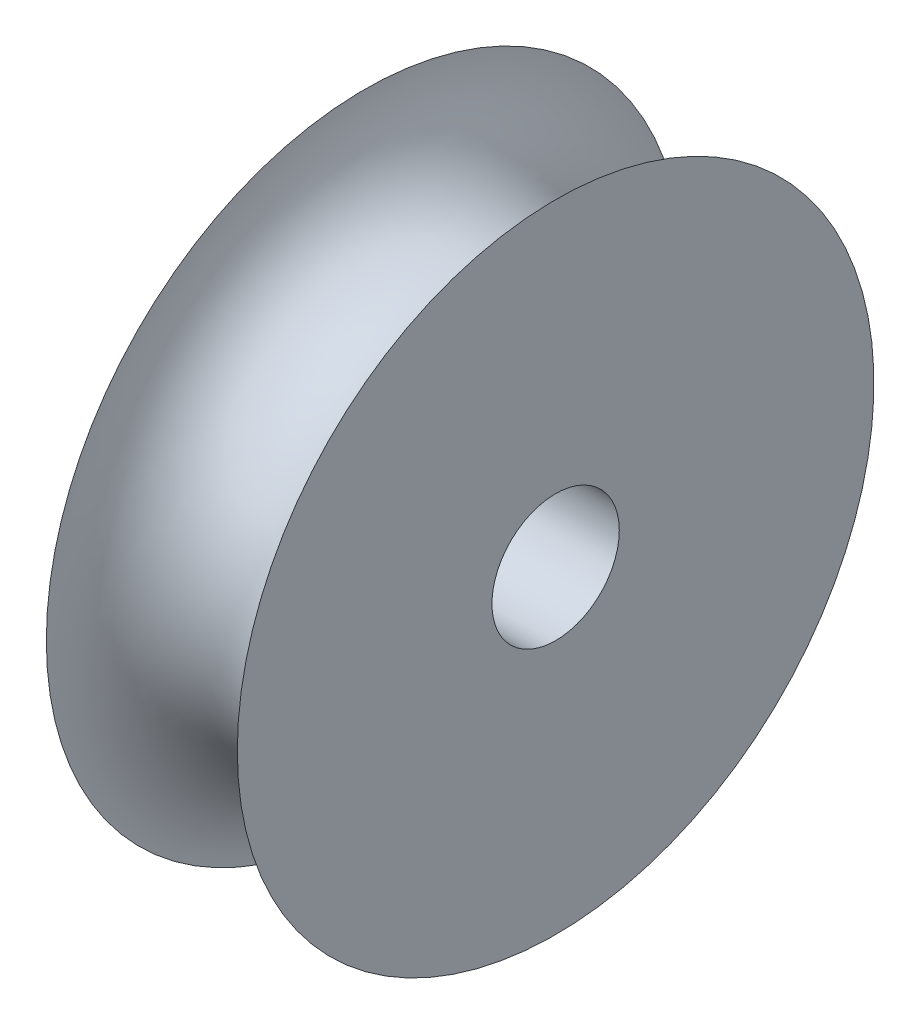
ISO-10303-21;
HEADER;
FILE_DESCRIPTION(('STEP AP214'),'2;1');
FILE_NAME('part.step','',(''),(''),'','','');
FILE_SCHEMA(('AUTOMOTIVE_DESIGN { 1 0 10303 214 1 1 1 1 }'));
ENDSEC;
DATA;
#1=APPLICATION_CONTEXT('core data for automotive mechanical design processes');
#2=APPLICATION_PROTOCOL_DEFINITION('international standard','automotive_design',2000,#1);
#3=PRODUCT_CONTEXT('',#1,'mechanical');
#4=PRODUCT('Part','Part','',(#3));
#5=PRODUCT_RELATED_PRODUCT_CATEGORY('part','',(#4));
#6=PRODUCT_DEFINITION_FORMATION('','',#4);
#7=PRODUCT_DEFINITION_CONTEXT('part definition',#1,'design');
#8=PRODUCT_DEFINITION('design','',#6,#7);
#9=PRODUCT_DEFINITION_SHAPE('','',#8);
#10=(LENGTH_UNIT() NAMED_UNIT(*) SI_UNIT(.MILLI.,.METRE.));
#11=(NAMED_UNIT(*) PLANE_ANGLE_UNIT() SI_UNIT($,.RADIAN.));
#12=(NAMED_UNIT(*) SI_UNIT($,.STERADIAN.) SOLID_ANGLE_UNIT());
#13=UNCERTAINTY_MEASURE_WITH_UNIT(LENGTH_MEASURE(1.E-05),#10,'distance_accuracy_value','');
#14=(GEOMETRIC_REPRESENTATION_CONTEXT(3) GLOBAL_UNCERTAINTY_ASSIGNED_CONTEXT((#13)) GLOBAL_UNIT_ASSIGNED_CONTEXT((#10,
#11,#12)) REPRESENTATION_CONTEXT('',''));
#15=CARTESIAN_POINT('',(0.,0.,0.));
#16=DIRECTION('',(0.,0.,1.));
#17=DIRECTION('',(1.,0.,0.));
#18=AXIS2_PLACEMENT_3D('',#15,#16,#17);
#19=CARTESIAN_POINT('',(4.7625,0.,0.));
#20=DIRECTION('',(-1.,0.,0.));
#21=DIRECTION('',(0.,0.,1.));
#22=AXIS2_PLACEMENT_3D('',#19,#20,#21);
#23=TOROIDAL_SURFACE('',#22,15.875,4.7625);
#24=CARTESIAN_POINT('',(0.,0.,0.));
#25=DIRECTION('',(-1.,0.,0.));
#26=DIRECTION('',(0.,0.,1.));
#27=AXIS2_PLACEMENT_3D('',#24,#25,#26);
#28=CIRCLE('',#27,15.875);
#29=CARTESIAN_POINT('',(0.,0.,15.875));
#30=VERTEX_POINT('',#29);
#31=EDGE_CURVE('E10',#30,#30,#28,.T.);
#32=ORIENTED_EDGE('',*,*,#31,.F.);
#33=EDGE_LOOP('',(#32));
#34=FACE_BOUND('',#33,.T.);
#35=CARTESIAN_POINT('',(9.525,0.,0.));
#36=DIRECTION('',(-1.,0.,0.));
#37=DIRECTION('',(0.,0.,1.));
#38=AXIS2_PLACEMENT_3D('',#35,#36,#37);
#39=CIRCLE('',#38,15.875);
#40=CARTESIAN_POINT('',(9.525,0.,15.875));
#41=VERTEX_POINT('',#40);
#42=EDGE_CURVE('E37',#41,#41,#39,.T.);
#43=ORIENTED_EDGE('',*,*,#42,.T.);
#44=EDGE_LOOP('',(#43));
#45=FACE_BOUND('',#44,.T.);
#46=ADVANCED_FACE('F31',(#34,#45),#23,.F.);
#47=CARTESIAN_POINT('',(0.,15.875,0.));
#48=DIRECTION('',(1.,0.,0.));
#49=DIRECTION('',(0.,0.,-1.));
#50=AXIS2_PLACEMENT_3D('',#47,#48,#49);
#51=PLANE('',#50);
#52=CARTESIAN_POINT('',(0.,0.,0.));
#53=DIRECTION('',(1.,0.,0.));
#54=DIRECTION('',(0.,0.,-1.));
#55=AXIS2_PLACEMENT_3D('',#52,#53,#54);
#56=CIRCLE('',#55,3.175);
#57=CARTESIAN_POINT('',(0.,0.,-3.175));
#58=VERTEX_POINT('',#57);
#59=EDGE_CURVE('E41',#58,#58,#56,.T.);
#60=ORIENTED_EDGE('',*,*,#59,.T.);
#61=EDGE_LOOP('',(#60));
#62=FACE_BOUND('',#61,.T.);
#63=ORIENTED_EDGE('',*,*,#31,.T.);
#64=EDGE_LOOP('',(#63));
#65=FACE_BOUND('',#64,.T.);
#66=ADVANCED_FACE('F56',(#62,#65),#51,.F.);
#67=CARTESIAN_POINT('',(9.525,0.,0.));
#68=DIRECTION('',(-1.,0.,0.));
#69=DIRECTION('',(0.,0.,1.));
#70=AXIS2_PLACEMENT_3D('',#67,#68,#69);
#71=PLANE('',#70);
#72=CARTESIAN_POINT('',(9.525,0.,0.));
#73=DIRECTION('',(1.,0.,0.));
#74=DIRECTION('',(0.,0.,-1.));
#75=AXIS2_PLACEMENT_3D('',#72,#73,#74);
#76=CIRCLE('',#75,3.175);
#77=CARTESIAN_POINT('',(9.525,0.,-3.175));
#78=VERTEX_POINT('',#77);
#79=EDGE_CURVE('E45',#78,#78,#76,.T.);
#80=ORIENTED_EDGE('',*,*,#79,.F.);
#81=EDGE_LOOP('',(#80));
#82=FACE_BOUND('',#81,.T.);
#83=ORIENTED_EDGE('',*,*,#42,.F.);
#84=EDGE_LOOP('',(#83));
#85=FACE_BOUND('',#84,.T.);
#86=ADVANCED_FACE('F53',(#82,#85),#71,.F.);
#87=CARTESIAN_POINT('',(0.,0.,0.));
#88=DIRECTION('',(1.,0.,0.));
#89=DIRECTION('',(0.,0.,-1.));
#90=AXIS2_PLACEMENT_3D('',#87,#88,#89);
#91=CYLINDRICAL_SURFACE('',#90,3.175);
#92=ORIENTED_EDGE('',*,*,#59,.F.);
#93=EDGE_LOOP('',(#92));
#94=FACE_BOUND('',#93,.T.);
#95=ORIENTED_EDGE('',*,*,#79,.T.);
#96=EDGE_LOOP('',(#95));
#97=FACE_BOUND('',#96,.T.);
#98=ADVANCED_FACE('F51',(#94,#97),#91,.F.);
#99=CLOSED_SHELL('',(#46,#66,#86,#98));
#100=MANIFOLD_SOLID_BREP('B2',#99);
#101=ADVANCED_BREP_SHAPE_REPRESENTATION('',(#18,#100),#14);
#102=SHAPE_DEFINITION_REPRESENTATION(#9,#101);
ENDSEC;
END-ISO-10303-21;
